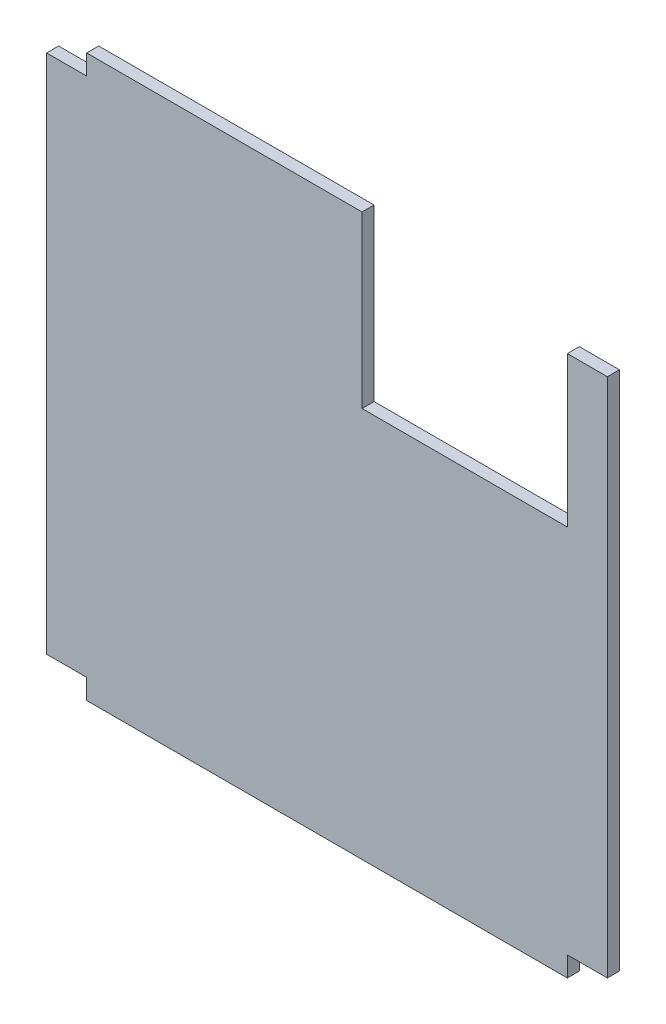
ISO-10303-21;
HEADER;
FILE_DESCRIPTION(('STEP AP214'),'2;1');
FILE_NAME('part.step','',(''),(''),'','','');
FILE_SCHEMA(('AUTOMOTIVE_DESIGN { 1 0 10303 214 1 1 1 1 }'));
ENDSEC;
DATA;
#1=APPLICATION_CONTEXT('core data for automotive mechanical design processes');
#2=APPLICATION_PROTOCOL_DEFINITION('international standard','automotive_design',2000,#1);
#3=PRODUCT_CONTEXT('',#1,'mechanical');
#4=PRODUCT('Part','Part','',(#3));
#5=PRODUCT_RELATED_PRODUCT_CATEGORY('part','',(#4));
#6=PRODUCT_DEFINITION_FORMATION('','',#4);
#7=PRODUCT_DEFINITION_CONTEXT('part definition',#1,'design');
#8=PRODUCT_DEFINITION('design','',#6,#7);
#9=PRODUCT_DEFINITION_SHAPE('','',#8);
#10=(LENGTH_UNIT() NAMED_UNIT(*) SI_UNIT(.MILLI.,.METRE.));
#11=(NAMED_UNIT(*) PLANE_ANGLE_UNIT() SI_UNIT($,.RADIAN.));
#12=(NAMED_UNIT(*) SI_UNIT($,.STERADIAN.) SOLID_ANGLE_UNIT());
#13=UNCERTAINTY_MEASURE_WITH_UNIT(LENGTH_MEASURE(1.E-05),#10,'distance_accuracy_value','');
#14=(GEOMETRIC_REPRESENTATION_CONTEXT(3) GLOBAL_UNCERTAINTY_ASSIGNED_CONTEXT((#13)) GLOBAL_UNIT_ASSIGNED_CONTEXT((#10,
#11,#12)) REPRESENTATION_CONTEXT('',''));
#15=CARTESIAN_POINT('',(0.,0.,0.));
#16=DIRECTION('',(0.,0.,1.));
#17=DIRECTION('',(1.,0.,0.));
#18=AXIS2_PLACEMENT_3D('',#15,#16,#17);
#19=CARTESIAN_POINT('',(0.,-540.,12.));
#20=DIRECTION('',(0.,-1.,0.));
#21=DIRECTION('',(1.,0.,0.));
#22=AXIS2_PLACEMENT_3D('',#19,#20,#21);
#23=PLANE('',#22);
#24=DIRECTION('',(-1.,0.,0.));
#25=VECTOR('',#24,1.);
#26=CARTESIAN_POINT('',(0.,-540.,0.));
#27=LINE('',#26,#25);
#28=CARTESIAN_POINT('',(0.,-540.,0.));
#29=VERTEX_POINT('',#28);
#30=CARTESIAN_POINT('',(-39.9999999999998,-540.,0.));
#31=VERTEX_POINT('',#30);
#32=EDGE_CURVE('E156',#29,#31,#27,.T.);
#33=ORIENTED_EDGE('',*,*,#32,.F.);
#34=DIRECTION('',(0.,0.,-1.));
#35=VECTOR('',#34,1.);
#36=CARTESIAN_POINT('',(0.,-540.,12.));
#37=LINE('',#36,#35);
#38=CARTESIAN_POINT('',(0.,-540.,12.));
#39=VERTEX_POINT('',#38);
#40=EDGE_CURVE('E11',#39,#29,#37,.T.);
#41=ORIENTED_EDGE('',*,*,#40,.F.);
#42=DIRECTION('',(-1.,0.,0.));
#43=VECTOR('',#42,1.);
#44=CARTESIAN_POINT('',(0.,-540.,12.));
#45=LINE('',#44,#43);
#46=CARTESIAN_POINT('',(-39.9999999999998,-540.,12.));
#47=VERTEX_POINT('',#46);
#48=EDGE_CURVE('E184',#39,#47,#45,.T.);
#49=ORIENTED_EDGE('',*,*,#48,.T.);
#50=DIRECTION('',(0.,0.,-1.));
#51=VECTOR('',#50,1.);
#52=CARTESIAN_POINT('',(-39.9999999999998,-540.,12.));
#53=LINE('',#52,#51);
#54=EDGE_CURVE('E36',#47,#31,#53,.T.);
#55=ORIENTED_EDGE('',*,*,#54,.T.);
#56=EDGE_LOOP('',(#33,#41,#49,#55));
#57=FACE_BOUND('',#56,.T.);
#58=ADVANCED_FACE('F33',(#57),#23,.T.);
#59=CARTESIAN_POINT('',(0.,-560.,12.));
#60=DIRECTION('',(-1.,0.,0.));
#61=DIRECTION('',(0.,0.,1.));
#62=AXIS2_PLACEMENT_3D('',#59,#60,#61);
#63=PLANE('',#62);
#64=DIRECTION('',(0.,1.,0.));
#65=VECTOR('',#64,1.);
#66=CARTESIAN_POINT('',(0.,-560.,0.));
#67=LINE('',#66,#65);
#68=CARTESIAN_POINT('',(0.,-560.,0.));
#69=VERTEX_POINT('',#68);
#70=EDGE_CURVE('E182',#69,#29,#67,.T.);
#71=ORIENTED_EDGE('',*,*,#70,.F.);
#72=DIRECTION('',(0.,0.,-1.));
#73=VECTOR('',#72,1.);
#74=CARTESIAN_POINT('',(0.,-560.,12.));
#75=LINE('',#74,#73);
#76=CARTESIAN_POINT('',(0.,-560.,12.));
#77=VERTEX_POINT('',#76);
#78=EDGE_CURVE('E41',#77,#69,#75,.T.);
#79=ORIENTED_EDGE('',*,*,#78,.F.);
#80=DIRECTION('',(0.,1.,0.));
#81=VECTOR('',#80,1.);
#82=CARTESIAN_POINT('',(0.,-560.,12.));
#83=LINE('',#82,#81);
#84=EDGE_CURVE('E146',#77,#39,#83,.T.);
#85=ORIENTED_EDGE('',*,*,#84,.T.);
#86=ORIENTED_EDGE('',*,*,#40,.T.);
#87=EDGE_LOOP('',(#71,#79,#85,#86));
#88=FACE_BOUND('',#87,.T.);
#89=ADVANCED_FACE('F204',(#88),#63,.T.);
#90=CARTESIAN_POINT('',(480.,-560.,12.));
#91=DIRECTION('',(0.,-1.,0.));
#92=DIRECTION('',(1.,0.,0.));
#93=AXIS2_PLACEMENT_3D('',#90,#91,#92);
#94=PLANE('',#93);
#95=DIRECTION('',(-1.,0.,0.));
#96=VECTOR('',#95,1.);
#97=CARTESIAN_POINT('',(480.,-560.,0.));
#98=LINE('',#97,#96);
#99=CARTESIAN_POINT('',(480.,-560.,0.));
#100=VERTEX_POINT('',#99);
#101=EDGE_CURVE('E132',#100,#69,#98,.T.);
#102=ORIENTED_EDGE('',*,*,#101,.F.);
#103=DIRECTION('',(0.,0.,-1.));
#104=VECTOR('',#103,1.);
#105=CARTESIAN_POINT('',(480.,-560.,12.));
#106=LINE('',#105,#104);
#107=CARTESIAN_POINT('',(480.,-560.,12.));
#108=VERTEX_POINT('',#107);
#109=EDGE_CURVE('E126',#108,#100,#106,.T.);
#110=ORIENTED_EDGE('',*,*,#109,.F.);
#111=DIRECTION('',(-1.,0.,0.));
#112=VECTOR('',#111,1.);
#113=CARTESIAN_POINT('',(480.,-560.,12.));
#114=LINE('',#113,#112);
#115=EDGE_CURVE('E129',#108,#77,#114,.T.);
#116=ORIENTED_EDGE('',*,*,#115,.T.);
#117=ORIENTED_EDGE('',*,*,#78,.T.);
#118=EDGE_LOOP('',(#102,#110,#116,#117));
#119=FACE_BOUND('',#118,.T.);
#120=ADVANCED_FACE('F128',(#119),#94,.T.);
#121=CARTESIAN_POINT('',(480.,-540.,12.));
#122=DIRECTION('',(1.,0.,0.));
#123=DIRECTION('',(0.,0.,-1.));
#124=AXIS2_PLACEMENT_3D('',#121,#122,#123);
#125=PLANE('',#124);
#126=DIRECTION('',(0.,-1.,0.));
#127=VECTOR('',#126,1.);
#128=CARTESIAN_POINT('',(480.,-540.,0.));
#129=LINE('',#128,#127);
#130=CARTESIAN_POINT('',(480.,-540.,0.));
#131=VERTEX_POINT('',#130);
#132=EDGE_CURVE('E179',#131,#100,#129,.T.);
#133=ORIENTED_EDGE('',*,*,#132,.F.);
#134=DIRECTION('',(0.,0.,-1.));
#135=VECTOR('',#134,1.);
#136=CARTESIAN_POINT('',(480.,-540.,12.));
#137=LINE('',#136,#135);
#138=CARTESIAN_POINT('',(480.,-540.,12.));
#139=VERTEX_POINT('',#138);
#140=EDGE_CURVE('E137',#139,#131,#137,.T.);
#141=ORIENTED_EDGE('',*,*,#140,.F.);
#142=DIRECTION('',(0.,-1.,0.));
#143=VECTOR('',#142,1.);
#144=CARTESIAN_POINT('',(480.,-540.,12.));
#145=LINE('',#144,#143);
#146=EDGE_CURVE('E144',#139,#108,#145,.T.);
#147=ORIENTED_EDGE('',*,*,#146,.T.);
#148=ORIENTED_EDGE('',*,*,#109,.T.);
#149=EDGE_LOOP('',(#133,#141,#147,#148));
#150=FACE_BOUND('',#149,.T.);
#151=ADVANCED_FACE('F148',(#150),#125,.T.);
#152=CARTESIAN_POINT('',(520.,-540.,12.));
#153=DIRECTION('',(0.,-1.,0.));
#154=DIRECTION('',(1.,0.,0.));
#155=AXIS2_PLACEMENT_3D('',#152,#153,#154);
#156=PLANE('',#155);
#157=DIRECTION('',(-1.,0.,0.));
#158=VECTOR('',#157,1.);
#159=CARTESIAN_POINT('',(520.,-540.,0.));
#160=LINE('',#159,#158);
#161=CARTESIAN_POINT('',(520.,-540.,0.));
#162=VERTEX_POINT('',#161);
#163=EDGE_CURVE('E176',#162,#131,#160,.T.);
#164=ORIENTED_EDGE('',*,*,#163,.F.);
#165=DIRECTION('',(0.,0.,-1.));
#166=VECTOR('',#165,1.);
#167=CARTESIAN_POINT('',(520.,-540.,12.));
#168=LINE('',#167,#166);
#169=CARTESIAN_POINT('',(520.,-540.,12.));
#170=VERTEX_POINT('',#169);
#171=EDGE_CURVE('E188',#170,#162,#168,.T.);
#172=ORIENTED_EDGE('',*,*,#171,.F.);
#173=DIRECTION('',(-1.,0.,0.));
#174=VECTOR('',#173,1.);
#175=CARTESIAN_POINT('',(520.,-540.,12.));
#176=LINE('',#175,#174);
#177=EDGE_CURVE('E149',#170,#139,#176,.T.);
#178=ORIENTED_EDGE('',*,*,#177,.T.);
#179=ORIENTED_EDGE('',*,*,#140,.T.);
#180=EDGE_LOOP('',(#164,#172,#178,#179));
#181=FACE_BOUND('',#180,.T.);
#182=ADVANCED_FACE('F217',(#181),#156,.T.);
#183=CARTESIAN_POINT('',(520.,-19.9999999999999,12.));
#184=DIRECTION('',(1.,0.,0.));
#185=DIRECTION('',(0.,1.,0.));
#186=AXIS2_PLACEMENT_3D('',#183,#184,#185);
#187=PLANE('',#186);
#188=DIRECTION('',(0.,-1.,0.));
#189=VECTOR('',#188,1.);
#190=CARTESIAN_POINT('',(520.,-19.9999999999999,0.));
#191=LINE('',#190,#189);
#192=CARTESIAN_POINT('',(520.,-19.9999999999999,0.));
#193=VERTEX_POINT('',#192);
#194=EDGE_CURVE('E173',#193,#162,#191,.T.);
#195=ORIENTED_EDGE('',*,*,#194,.F.);
#196=DIRECTION('',(0.,0.,-1.));
#197=VECTOR('',#196,1.);
#198=CARTESIAN_POINT('',(520.,-19.9999999999999,12.));
#199=LINE('',#198,#197);
#200=CARTESIAN_POINT('',(520.,-19.9999999999999,12.));
#201=VERTEX_POINT('',#200);
#202=EDGE_CURVE('E190',#201,#193,#199,.T.);
#203=ORIENTED_EDGE('',*,*,#202,.F.);
#204=DIRECTION('',(0.,-1.,0.));
#205=VECTOR('',#204,1.);
#206=CARTESIAN_POINT('',(520.,-19.9999999999999,12.));
#207=LINE('',#206,#205);
#208=EDGE_CURVE('E151',#201,#170,#207,.T.);
#209=ORIENTED_EDGE('',*,*,#208,.T.);
#210=ORIENTED_EDGE('',*,*,#171,.T.);
#211=EDGE_LOOP('',(#195,#203,#209,#210));
#212=FACE_BOUND('',#211,.T.);
#213=ADVANCED_FACE('F220',(#212),#187,.T.);
#214=CARTESIAN_POINT('',(480.,-20.,12.));
#215=DIRECTION('',(0.,1.,0.));
#216=DIRECTION('',(-1.,0.,0.));
#217=AXIS2_PLACEMENT_3D('',#214,#215,#216);
#218=PLANE('',#217);
#219=DIRECTION('',(0.,0.,-1.));
#220=VECTOR('',#219,1.);
#221=CARTESIAN_POINT('',(480.,-20.,12.));
#222=LINE('',#221,#220);
#223=CARTESIAN_POINT('',(480.,-20.,12.));
#224=VERTEX_POINT('',#223);
#225=CARTESIAN_POINT('',(480.,-20.,0.));
#226=VERTEX_POINT('',#225);
#227=EDGE_CURVE('E265',#224,#226,#222,.T.);
#228=ORIENTED_EDGE('',*,*,#227,.F.);
#229=DIRECTION('',(1.,0.,0.));
#230=VECTOR('',#229,1.);
#231=CARTESIAN_POINT('',(480.,-20.,12.));
#232=LINE('',#231,#230);
#233=EDGE_CURVE('E282',#224,#201,#232,.T.);
#234=ORIENTED_EDGE('',*,*,#233,.T.);
#235=ORIENTED_EDGE('',*,*,#202,.T.);
#236=DIRECTION('',(1.,0.,0.));
#237=VECTOR('',#236,1.);
#238=CARTESIAN_POINT('',(480.,-20.,0.));
#239=LINE('',#238,#237);
#240=EDGE_CURVE('E171',#226,#193,#239,.T.);
#241=ORIENTED_EDGE('',*,*,#240,.F.);
#242=EDGE_LOOP('',(#228,#234,#235,#241));
#243=FACE_BOUND('',#242,.T.);
#244=ADVANCED_FACE('F224',(#243),#218,.T.);
#245=CARTESIAN_POINT('',(0.,0.,12.));
#246=DIRECTION('',(0.,1.,0.));
#247=DIRECTION('',(0.,0.,1.));
#248=AXIS2_PLACEMENT_3D('',#245,#246,#247);
#249=PLANE('',#248);
#250=DIRECTION('',(0.,0.,1.));
#251=VECTOR('',#250,1.);
#252=CARTESIAN_POINT('',(275.,0.,0.));
#253=LINE('',#252,#251);
#254=CARTESIAN_POINT('',(275.,0.,0.));
#255=VERTEX_POINT('',#254);
#256=CARTESIAN_POINT('',(275.,0.,12.));
#257=VERTEX_POINT('',#256);
#258=EDGE_CURVE('E298',#255,#257,#253,.T.);
#259=ORIENTED_EDGE('',*,*,#258,.F.);
#260=DIRECTION('',(1.,0.,0.));
#261=VECTOR('',#260,1.);
#262=CARTESIAN_POINT('',(0.,0.,0.));
#263=LINE('',#262,#261);
#264=CARTESIAN_POINT('',(0.,0.,0.));
#265=VERTEX_POINT('',#264);
#266=EDGE_CURVE('E168',#265,#255,#263,.T.);
#267=ORIENTED_EDGE('',*,*,#266,.F.);
#268=DIRECTION('',(0.,0.,-1.));
#269=VECTOR('',#268,1.);
#270=CARTESIAN_POINT('',(0.,0.,12.));
#271=LINE('',#270,#269);
#272=CARTESIAN_POINT('',(0.,0.,12.));
#273=VERTEX_POINT('',#272);
#274=EDGE_CURVE('E193',#273,#265,#271,.T.);
#275=ORIENTED_EDGE('',*,*,#274,.F.);
#276=DIRECTION('',(1.,0.,0.));
#277=VECTOR('',#276,1.);
#278=CARTESIAN_POINT('',(0.,0.,12.));
#279=LINE('',#278,#277);
#280=EDGE_CURVE('E286',#273,#257,#279,.T.);
#281=ORIENTED_EDGE('',*,*,#280,.T.);
#282=EDGE_LOOP('',(#259,#267,#275,#281));
#283=FACE_BOUND('',#282,.T.);
#284=ADVANCED_FACE('F228',(#283),#249,.T.);
#285=CARTESIAN_POINT('',(0.,0.,12.));
#286=DIRECTION('',(1.,0.,0.));
#287=DIRECTION('',(0.,1.,0.));
#288=AXIS2_PLACEMENT_3D('',#285,#286,#287);
#289=PLANE('',#288);
#290=DIRECTION('',(0.,-1.,0.));
#291=VECTOR('',#290,1.);
#292=CARTESIAN_POINT('',(0.,0.,0.));
#293=LINE('',#292,#291);
#294=CARTESIAN_POINT('',(0.,-20.,0.));
#295=VERTEX_POINT('',#294);
#296=EDGE_CURVE('E166',#265,#295,#293,.T.);
#297=ORIENTED_EDGE('',*,*,#296,.T.);
#298=DIRECTION('',(0.,0.,-1.));
#299=VECTOR('',#298,1.);
#300=CARTESIAN_POINT('',(0.,-20.,12.));
#301=LINE('',#300,#299);
#302=CARTESIAN_POINT('',(0.,-20.,12.));
#303=VERTEX_POINT('',#302);
#304=EDGE_CURVE('E195',#303,#295,#301,.T.);
#305=ORIENTED_EDGE('',*,*,#304,.F.);
#306=DIRECTION('',(0.,-1.,0.));
#307=VECTOR('',#306,1.);
#308=CARTESIAN_POINT('',(0.,0.,12.));
#309=LINE('',#308,#307);
#310=EDGE_CURVE('E291',#273,#303,#309,.T.);
#311=ORIENTED_EDGE('',*,*,#310,.F.);
#312=ORIENTED_EDGE('',*,*,#274,.T.);
#313=EDGE_LOOP('',(#297,#305,#311,#312));
#314=FACE_BOUND('',#313,.T.);
#315=ADVANCED_FACE('F232',(#314),#289,.F.);
#316=CARTESIAN_POINT('',(0.,-20.,12.));
#317=DIRECTION('',(0.,-1.,0.));
#318=DIRECTION('',(1.,0.,0.));
#319=AXIS2_PLACEMENT_3D('',#316,#317,#318);
#320=PLANE('',#319);
#321=DIRECTION('',(-1.,0.,0.));
#322=VECTOR('',#321,1.);
#323=CARTESIAN_POINT('',(0.,-20.,0.));
#324=LINE('',#323,#322);
#325=CARTESIAN_POINT('',(-40.,-20.,0.));
#326=VERTEX_POINT('',#325);
#327=EDGE_CURVE('E163',#295,#326,#324,.T.);
#328=ORIENTED_EDGE('',*,*,#327,.T.);
#329=DIRECTION('',(0.,0.,-1.));
#330=VECTOR('',#329,1.);
#331=CARTESIAN_POINT('',(-40.,-20.,12.));
#332=LINE('',#331,#330);
#333=CARTESIAN_POINT('',(-40.,-20.,12.));
#334=VERTEX_POINT('',#333);
#335=EDGE_CURVE('E197',#334,#326,#332,.T.);
#336=ORIENTED_EDGE('',*,*,#335,.F.);
#337=DIRECTION('',(-1.,0.,0.));
#338=VECTOR('',#337,1.);
#339=CARTESIAN_POINT('',(0.,-20.,12.));
#340=LINE('',#339,#338);
#341=EDGE_CURVE('E293',#303,#334,#340,.T.);
#342=ORIENTED_EDGE('',*,*,#341,.F.);
#343=ORIENTED_EDGE('',*,*,#304,.T.);
#344=EDGE_LOOP('',(#328,#336,#342,#343));
#345=FACE_BOUND('',#344,.T.);
#346=ADVANCED_FACE('F236',(#345),#320,.F.);
#347=CARTESIAN_POINT('',(-39.9999999999998,-540.,12.));
#348=DIRECTION('',(-1.,0.,0.));
#349=DIRECTION('',(0.,-1.,0.));
#350=AXIS2_PLACEMENT_3D('',#347,#348,#349);
#351=PLANE('',#350);
#352=DIRECTION('',(0.,1.,0.));
#353=VECTOR('',#352,1.);
#354=CARTESIAN_POINT('',(-39.9999999999998,-540.,0.));
#355=LINE('',#354,#353);
#356=EDGE_CURVE('E159',#31,#326,#355,.T.);
#357=ORIENTED_EDGE('',*,*,#356,.F.);
#358=ORIENTED_EDGE('',*,*,#54,.F.);
#359=DIRECTION('',(0.,1.,0.));
#360=VECTOR('',#359,1.);
#361=CARTESIAN_POINT('',(-39.9999999999998,-540.,12.));
#362=LINE('',#361,#360);
#363=EDGE_CURVE('E295',#47,#334,#362,.T.);
#364=ORIENTED_EDGE('',*,*,#363,.T.);
#365=ORIENTED_EDGE('',*,*,#335,.T.);
#366=EDGE_LOOP('',(#357,#358,#364,#365));
#367=FACE_BOUND('',#366,.T.);
#368=ADVANCED_FACE('F199',(#367),#351,.T.);
#369=CARTESIAN_POINT('',(0.,0.,12.));
#370=DIRECTION('',(0.,0.,-1.));
#371=DIRECTION('',(-1.,0.,0.));
#372=AXIS2_PLACEMENT_3D('',#369,#370,#371);
#373=PLANE('',#372);
#374=ORIENTED_EDGE('',*,*,#233,.F.);
#375=DIRECTION('',(0.,1.,0.));
#376=VECTOR('',#375,1.);
#377=CARTESIAN_POINT('',(480.000000000001,-170.,12.));
#378=LINE('',#377,#376);
#379=CARTESIAN_POINT('',(480.000000000001,-170.,12.));
#380=VERTEX_POINT('',#379);
#381=EDGE_CURVE('E271',#380,#224,#378,.T.);
#382=ORIENTED_EDGE('',*,*,#381,.F.);
#383=DIRECTION('',(1.,0.,0.));
#384=VECTOR('',#383,1.);
#385=CARTESIAN_POINT('',(480.,-170.,12.));
#386=LINE('',#385,#384);
#387=CARTESIAN_POINT('',(275.,-170.,12.));
#388=VERTEX_POINT('',#387);
#389=EDGE_CURVE('E302',#388,#380,#386,.T.);
#390=ORIENTED_EDGE('',*,*,#389,.F.);
#391=DIRECTION('',(0.,-1.,0.));
#392=VECTOR('',#391,1.);
#393=CARTESIAN_POINT('',(275.,0.,12.));
#394=LINE('',#393,#392);
#395=EDGE_CURVE('E278',#257,#388,#394,.T.);
#396=ORIENTED_EDGE('',*,*,#395,.F.);
#397=ORIENTED_EDGE('',*,*,#280,.F.);
#398=ORIENTED_EDGE('',*,*,#310,.T.);
#399=ORIENTED_EDGE('',*,*,#341,.T.);
#400=ORIENTED_EDGE('',*,*,#363,.F.);
#401=ORIENTED_EDGE('',*,*,#48,.F.);
#402=ORIENTED_EDGE('',*,*,#84,.F.);
#403=ORIENTED_EDGE('',*,*,#115,.F.);
#404=ORIENTED_EDGE('',*,*,#146,.F.);
#405=ORIENTED_EDGE('',*,*,#177,.F.);
#406=ORIENTED_EDGE('',*,*,#208,.F.);
#407=EDGE_LOOP('',(#374,#382,#390,#396,#397,#398,#399,#400,#401,#402,#403,#404,#405,#406));
#408=FACE_BOUND('',#407,.T.);
#409=ADVANCED_FACE('F142',(#408),#373,.F.);
#410=CARTESIAN_POINT('',(0.,0.,0.));
#411=DIRECTION('',(0.,0.,-1.));
#412=DIRECTION('',(-1.,0.,0.));
#413=AXIS2_PLACEMENT_3D('',#410,#411,#412);
#414=PLANE('',#413);
#415=DIRECTION('',(0.,1.,0.));
#416=VECTOR('',#415,1.);
#417=CARTESIAN_POINT('',(480.000000000001,-170.,0.));
#418=LINE('',#417,#416);
#419=CARTESIAN_POINT('',(480.000000000001,-170.,0.));
#420=VERTEX_POINT('',#419);
#421=EDGE_CURVE('E268',#420,#226,#418,.T.);
#422=ORIENTED_EDGE('',*,*,#421,.T.);
#423=ORIENTED_EDGE('',*,*,#240,.T.);
#424=ORIENTED_EDGE('',*,*,#194,.T.);
#425=ORIENTED_EDGE('',*,*,#163,.T.);
#426=ORIENTED_EDGE('',*,*,#132,.T.);
#427=ORIENTED_EDGE('',*,*,#101,.T.);
#428=ORIENTED_EDGE('',*,*,#70,.T.);
#429=ORIENTED_EDGE('',*,*,#32,.T.);
#430=ORIENTED_EDGE('',*,*,#356,.T.);
#431=ORIENTED_EDGE('',*,*,#327,.F.);
#432=ORIENTED_EDGE('',*,*,#296,.F.);
#433=ORIENTED_EDGE('',*,*,#266,.T.);
#434=DIRECTION('',(0.,-1.,0.));
#435=VECTOR('',#434,1.);
#436=CARTESIAN_POINT('',(275.,0.,0.));
#437=LINE('',#436,#435);
#438=CARTESIAN_POINT('',(275.,-170.,0.));
#439=VERTEX_POINT('',#438);
#440=EDGE_CURVE('E305',#255,#439,#437,.T.);
#441=ORIENTED_EDGE('',*,*,#440,.T.);
#442=DIRECTION('',(1.,0.,0.));
#443=VECTOR('',#442,1.);
#444=CARTESIAN_POINT('',(480.,-170.,0.));
#445=LINE('',#444,#443);
#446=EDGE_CURVE('E49',#439,#420,#445,.T.);
#447=ORIENTED_EDGE('',*,*,#446,.T.);
#448=EDGE_LOOP('',(#422,#423,#424,#425,#426,#427,#428,#429,#430,#431,#432,#433,#441,#447));
#449=FACE_BOUND('',#448,.T.);
#450=ADVANCED_FACE('F203',(#449),#414,.T.);
#451=CARTESIAN_POINT('',(480.,-170.,0.));
#452=DIRECTION('',(0.,-1.,0.));
#453=DIRECTION('',(1.,0.,0.));
#454=AXIS2_PLACEMENT_3D('',#451,#452,#453);
#455=PLANE('',#454);
#456=ORIENTED_EDGE('',*,*,#389,.T.);
#457=DIRECTION('',(0.,0.,-1.));
#458=VECTOR('',#457,1.);
#459=CARTESIAN_POINT('',(480.000000000001,-170.,12.));
#460=LINE('',#459,#458);
#461=EDGE_CURVE('E275',#380,#420,#460,.T.);
#462=ORIENTED_EDGE('',*,*,#461,.T.);
#463=ORIENTED_EDGE('',*,*,#446,.F.);
#464=DIRECTION('',(0.,0.,1.));
#465=VECTOR('',#464,1.);
#466=CARTESIAN_POINT('',(275.,-170.,0.));
#467=LINE('',#466,#465);
#468=EDGE_CURVE('E160',#439,#388,#467,.T.);
#469=ORIENTED_EDGE('',*,*,#468,.T.);
#470=EDGE_LOOP('',(#456,#462,#463,#469));
#471=FACE_BOUND('',#470,.T.);
#472=ADVANCED_FACE('F247',(#471),#455,.F.);
#473=CARTESIAN_POINT('',(275.,0.,0.));
#474=DIRECTION('',(-1.,0.,0.));
#475=DIRECTION('',(0.,0.,1.));
#476=AXIS2_PLACEMENT_3D('',#473,#474,#475);
#477=PLANE('',#476);
#478=ORIENTED_EDGE('',*,*,#395,.T.);
#479=ORIENTED_EDGE('',*,*,#468,.F.);
#480=ORIENTED_EDGE('',*,*,#440,.F.);
#481=ORIENTED_EDGE('',*,*,#258,.T.);
#482=EDGE_LOOP('',(#478,#479,#480,#481));
#483=FACE_BOUND('',#482,.T.);
#484=ADVANCED_FACE('F249',(#483),#477,.F.);
#485=CARTESIAN_POINT('',(480.000000000001,-170.,12.));
#486=DIRECTION('',(1.,0.,0.));
#487=DIRECTION('',(0.,1.,0.));
#488=AXIS2_PLACEMENT_3D('',#485,#486,#487);
#489=PLANE('',#488);
#490=ORIENTED_EDGE('',*,*,#227,.T.);
#491=ORIENTED_EDGE('',*,*,#421,.F.);
#492=ORIENTED_EDGE('',*,*,#461,.F.);
#493=ORIENTED_EDGE('',*,*,#381,.T.);
#494=EDGE_LOOP('',(#490,#491,#492,#493));
#495=FACE_BOUND('',#494,.T.);
#496=ADVANCED_FACE('F252',(#495),#489,.F.);
#497=CLOSED_SHELL('',(#58,#89,#120,#151,#182,#213,#244,#284,#315,#346,#368,#409,#450,#472,#484,#496));
#498=MANIFOLD_SOLID_BREP('B2',#497);
#499=ADVANCED_BREP_SHAPE_REPRESENTATION('',(#18,#498),#14);
#500=SHAPE_DEFINITION_REPRESENTATION(#9,#499);
ENDSEC;
END-ISO-10303-21;
